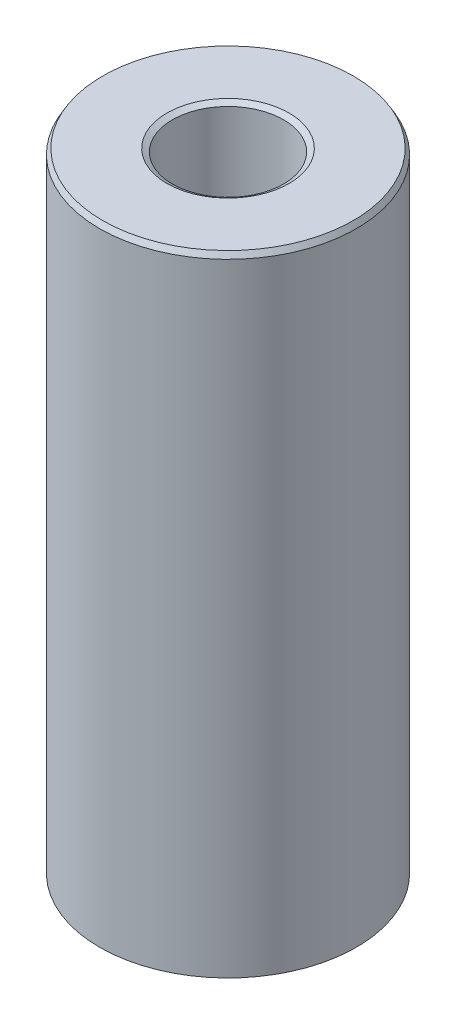
ISO-10303-21;
HEADER;
FILE_DESCRIPTION(('STEP AP214'),'2;1');
FILE_NAME('part.step','',(''),(''),'','','');
FILE_SCHEMA(('AUTOMOTIVE_DESIGN { 1 0 10303 214 1 1 1 1 }'));
ENDSEC;
DATA;
#1=APPLICATION_CONTEXT('core data for automotive mechanical design processes');
#2=APPLICATION_PROTOCOL_DEFINITION('international standard','automotive_design',2000,#1);
#3=PRODUCT_CONTEXT('',#1,'mechanical');
#4=PRODUCT('Part','Part','',(#3));
#5=PRODUCT_RELATED_PRODUCT_CATEGORY('part','',(#4));
#6=PRODUCT_DEFINITION_FORMATION('','',#4);
#7=PRODUCT_DEFINITION_CONTEXT('part definition',#1,'design');
#8=PRODUCT_DEFINITION('design','',#6,#7);
#9=PRODUCT_DEFINITION_SHAPE('','',#8);
#10=(LENGTH_UNIT() NAMED_UNIT(*) SI_UNIT(.MILLI.,.METRE.));
#11=(NAMED_UNIT(*) PLANE_ANGLE_UNIT() SI_UNIT($,.RADIAN.));
#12=(NAMED_UNIT(*) SI_UNIT($,.STERADIAN.) SOLID_ANGLE_UNIT());
#13=UNCERTAINTY_MEASURE_WITH_UNIT(LENGTH_MEASURE(1.E-05),#10,'distance_accuracy_value','');
#14=(GEOMETRIC_REPRESENTATION_CONTEXT(3) GLOBAL_UNCERTAINTY_ASSIGNED_CONTEXT((#13)) GLOBAL_UNIT_ASSIGNED_CONTEXT((#10,
#11,#12)) REPRESENTATION_CONTEXT('',''));
#15=CARTESIAN_POINT('',(0.,0.,0.));
#16=DIRECTION('',(0.,0.,1.));
#17=DIRECTION('',(1.,0.,0.));
#18=AXIS2_PLACEMENT_3D('',#15,#16,#17);
#19=CARTESIAN_POINT('',(0.,221.109307598909,0.));
#20=DIRECTION('',(0.,-1.,0.));
#21=DIRECTION('',(0.,0.,-1.));
#22=AXIS2_PLACEMENT_3D('',#19,#20,#21);
#23=CYLINDRICAL_SURFACE('',#22,45.);
#24=CARTESIAN_POINT('',(0.,1.09687432985134,0.));
#25=DIRECTION('',(0.,1.,0.));
#26=DIRECTION('',(0.,0.,1.));
#27=AXIS2_PLACEMENT_3D('',#24,#25,#26);
#28=CIRCLE('',#27,45.);
#29=CARTESIAN_POINT('',(0.,1.09687432985134,45.));
#30=VERTEX_POINT('',#29);
#31=EDGE_CURVE('E10',#30,#30,#28,.T.);
#32=ORIENTED_EDGE('',*,*,#31,.T.);
#33=EDGE_LOOP('',(#32));
#34=FACE_BOUND('',#33,.T.);
#35=CARTESIAN_POINT('',(0.,219.209465530089,0.));
#36=DIRECTION('',(0.,1.,0.));
#37=DIRECTION('',(0.,0.,1.));
#38=AXIS2_PLACEMENT_3D('',#35,#36,#37);
#39=CIRCLE('',#38,45.);
#40=CARTESIAN_POINT('',(0.,219.209465530089,-45.));
#41=VERTEX_POINT('',#40);
#42=EDGE_CURVE('E50',#41,#41,#39,.F.);
#43=ORIENTED_EDGE('',*,*,#42,.T.);
#44=EDGE_LOOP('',(#43));
#45=FACE_BOUND('',#44,.T.);
#46=ADVANCED_FACE('F39',(#34,#45),#23,.T.);
#47=CARTESIAN_POINT('',(0.,221.109307598909,0.));
#48=DIRECTION('',(0.,1.,0.));
#49=DIRECTION('',(0.,0.,1.));
#50=AXIS2_PLACEMENT_3D('',#47,#48,#49);
#51=PLANE('',#50);
#52=CARTESIAN_POINT('',(0.,221.109307598909,0.));
#53=DIRECTION('',(0.,1.,0.));
#54=DIRECTION('',(0.,0.,1.));
#55=AXIS2_PLACEMENT_3D('',#52,#53,#54);
#56=CIRCLE('',#55,21.4028291822832);
#57=CARTESIAN_POINT('',(0.,221.109307598909,21.4028291822832));
#58=VERTEX_POINT('',#57);
#59=EDGE_CURVE('E58',#58,#58,#56,.F.);
#60=ORIENTED_EDGE('',*,*,#59,.T.);
#61=EDGE_LOOP('',(#60));
#62=FACE_BOUND('',#61,.T.);
#63=CARTESIAN_POINT('',(0.,221.109307598909,0.));
#64=DIRECTION('',(0.,1.,0.));
#65=DIRECTION('',(0.,0.,1.));
#66=AXIS2_PLACEMENT_3D('',#63,#64,#65);
#67=CIRCLE('',#66,43.9031256701487);
#68=CARTESIAN_POINT('',(0.,221.109307598909,-43.9031256701487));
#69=VERTEX_POINT('',#68);
#70=EDGE_CURVE('E61',#69,#69,#67,.T.);
#71=ORIENTED_EDGE('',*,*,#70,.T.);
#72=EDGE_LOOP('',(#71));
#73=FACE_BOUND('',#72,.T.);
#74=ADVANCED_FACE('F88',(#62,#73),#51,.T.);
#75=CARTESIAN_POINT('',(0.,0.,0.));
#76=DIRECTION('',(0.,1.,0.));
#77=DIRECTION('',(0.,0.,1.));
#78=AXIS2_PLACEMENT_3D('',#75,#76,#77);
#79=PLANE('',#78);
#80=CARTESIAN_POINT('',(0.,0.,0.));
#81=DIRECTION('',(0.,1.,0.));
#82=DIRECTION('',(0.,0.,1.));
#83=AXIS2_PLACEMENT_3D('',#80,#81,#82);
#84=CIRCLE('',#83,20.5998614433139);
#85=CARTESIAN_POINT('',(0.,0.,20.5998614433139));
#86=VERTEX_POINT('',#85);
#87=EDGE_CURVE('E51',#86,#86,#84,.T.);
#88=ORIENTED_EDGE('',*,*,#87,.T.);
#89=EDGE_LOOP('',(#88));
#90=FACE_BOUND('',#89,.T.);
#91=CARTESIAN_POINT('',(0.,0.,0.));
#92=DIRECTION('',(0.,1.,0.));
#93=DIRECTION('',(0.,0.,1.));
#94=AXIS2_PLACEMENT_3D('',#91,#92,#93);
#95=CIRCLE('',#94,43.1001579311794);
#96=CARTESIAN_POINT('',(0.,0.,43.1001579311794));
#97=VERTEX_POINT('',#96);
#98=EDGE_CURVE('E54',#97,#97,#95,.F.);
#99=ORIENTED_EDGE('',*,*,#98,.T.);
#100=EDGE_LOOP('',(#99));
#101=FACE_BOUND('',#100,.T.);
#102=ADVANCED_FACE('F83',(#90,#101),#79,.F.);
#103=CARTESIAN_POINT('',(0.,221.109307598909,0.));
#104=DIRECTION('',(0.,-1.,0.));
#105=DIRECTION('',(0.,0.,-1.));
#106=AXIS2_PLACEMENT_3D('',#103,#104,#105);
#107=CYLINDRICAL_SURFACE('',#106,19.5029871134625);
#108=CARTESIAN_POINT('',(0.,220.012433269058,0.));
#109=DIRECTION('',(0.,1.,0.));
#110=DIRECTION('',(0.,0.,1.));
#111=AXIS2_PLACEMENT_3D('',#108,#109,#110);
#112=CIRCLE('',#111,19.5029871134625);
#113=CARTESIAN_POINT('',(0.,220.012433269058,19.5029871134625));
#114=VERTEX_POINT('',#113);
#115=EDGE_CURVE('E67',#114,#114,#112,.T.);
#116=ORIENTED_EDGE('',*,*,#115,.T.);
#117=EDGE_LOOP('',(#116));
#118=FACE_BOUND('',#117,.T.);
#119=CARTESIAN_POINT('',(0.,1.89984206882066,0.));
#120=DIRECTION('',(0.,1.,0.));
#121=DIRECTION('',(0.,0.,1.));
#122=AXIS2_PLACEMENT_3D('',#119,#120,#121);
#123=CIRCLE('',#122,19.5029871134625);
#124=CARTESIAN_POINT('',(0.,1.89984206882066,19.5029871134625));
#125=VERTEX_POINT('',#124);
#126=EDGE_CURVE('E69',#125,#125,#123,.F.);
#127=ORIENTED_EDGE('',*,*,#126,.T.);
#128=EDGE_LOOP('',(#127));
#129=FACE_BOUND('',#128,.T.);
#130=ADVANCED_FACE('F71',(#118,#129),#107,.F.);
#131=CARTESIAN_POINT('',(0.,220.012433269058,0.));
#132=DIRECTION('',(0.,1.,0.));
#133=DIRECTION('',(0.,0.,1.));
#134=AXIS2_PLACEMENT_3D('',#131,#132,#133);
#135=CONICAL_SURFACE('',#134,19.5029871134625,1.0471975511966);
#136=ORIENTED_EDGE('',*,*,#59,.F.);
#137=EDGE_LOOP('',(#136));
#138=FACE_BOUND('',#137,.T.);
#139=ORIENTED_EDGE('',*,*,#115,.F.);
#140=EDGE_LOOP('',(#139));
#141=FACE_BOUND('',#140,.T.);
#142=ADVANCED_FACE('F77',(#138,#141),#135,.F.);
#143=CARTESIAN_POINT('',(0.,0.,0.));
#144=DIRECTION('',(0.,-1.,0.));
#145=DIRECTION('',(0.,0.,-1.));
#146=AXIS2_PLACEMENT_3D('',#143,#144,#145);
#147=CONICAL_SURFACE('',#146,20.5998614433139,0.523598775598297);
#148=ORIENTED_EDGE('',*,*,#126,.F.);
#149=EDGE_LOOP('',(#148));
#150=FACE_BOUND('',#149,.T.);
#151=ORIENTED_EDGE('',*,*,#87,.F.);
#152=EDGE_LOOP('',(#151));
#153=FACE_BOUND('',#152,.T.);
#154=ADVANCED_FACE('F73',(#150,#153),#147,.F.);
#155=CARTESIAN_POINT('',(0.,1.09687432985134,0.));
#156=DIRECTION('',(0.,1.,0.));
#157=DIRECTION('',(0.,0.,1.));
#158=AXIS2_PLACEMENT_3D('',#155,#156,#157);
#159=CONICAL_SURFACE('',#158,45.,1.04719755119661);
#160=ORIENTED_EDGE('',*,*,#98,.F.);
#161=EDGE_LOOP('',(#160));
#162=FACE_BOUND('',#161,.T.);
#163=ORIENTED_EDGE('',*,*,#31,.F.);
#164=EDGE_LOOP('',(#163));
#165=FACE_BOUND('',#164,.T.);
#166=ADVANCED_FACE('F76',(#162,#165),#159,.T.);
#167=CARTESIAN_POINT('',(0.,221.109307598909,0.));
#168=DIRECTION('',(0.,-1.,0.));
#169=DIRECTION('',(0.,0.,-1.));
#170=AXIS2_PLACEMENT_3D('',#167,#168,#169);
#171=CONICAL_SURFACE('',#170,43.9031256701487,0.523598775598285);
#172=CARTESIAN_POINT('',(0.,219.209465530089,-45.));
#173=CARTESIAN_POINT('',(0.,219.229255551639,-44.9885742257307));
#174=CARTESIAN_POINT('',(0.,219.249045573189,-44.9771484514614));
#175=CARTESIAN_POINT('',(0.,219.28862561629,-44.9542969029229));
#176=CARTESIAN_POINT('',(0.,219.30841563784,-44.9428711286536));
#177=CARTESIAN_POINT('',(0.,219.34799568094,-44.920019580115));
#178=CARTESIAN_POINT('',(0.,219.367785702491,-44.9085938058457));
#179=CARTESIAN_POINT('',(0.,219.407365745591,-44.8857422573072));
#180=CARTESIAN_POINT('',(0.,219.427155767141,-44.8743164830379));
#181=CARTESIAN_POINT('',(0.,219.466735810242,-44.8514649344993));
#182=CARTESIAN_POINT('',(0.,219.486525831792,-44.84003916023));
#183=CARTESIAN_POINT('',(0.,219.526105874892,-44.8171876116915));
#184=CARTESIAN_POINT('',(0.,219.545895896442,-44.8057618374222));
#185=CARTESIAN_POINT('',(0.,219.585475939543,-44.7829102888836));
#186=CARTESIAN_POINT('',(0.,219.605265961093,-44.7714845146143));
#187=CARTESIAN_POINT('',(0.,219.644846004194,-44.7486329660757));
#188=CARTESIAN_POINT('',(0.,219.664636025744,-44.7372071918065));
#189=CARTESIAN_POINT('',(0.,219.704216068844,-44.7143556432679));
#190=CARTESIAN_POINT('',(0.,219.724006090394,-44.7029298689986));
#191=CARTESIAN_POINT('',(0.,219.763586133495,-44.68007832046));
#192=CARTESIAN_POINT('',(0.,219.783376155045,-44.6686525461908));
#193=CARTESIAN_POINT('',(0.,219.822956198146,-44.6458009976522));
#194=CARTESIAN_POINT('',(0.,219.842746219696,-44.6343752233829));
#195=CARTESIAN_POINT('',(0.,219.882326262796,-44.6115236748443));
#196=CARTESIAN_POINT('',(0.,219.902116284346,-44.6000979005751));
#197=CARTESIAN_POINT('',(0.,219.941696327447,-44.5772463520365));
#198=CARTESIAN_POINT('',(0.,219.961486348997,-44.5658205777672));
#199=CARTESIAN_POINT('',(0.,220.001066392097,-44.5429690292286));
#200=CARTESIAN_POINT('',(0.,220.020856413648,-44.5315432549593));
#201=CARTESIAN_POINT('',(0.,220.060436456748,-44.5086917064208));
#202=CARTESIAN_POINT('',(0.,220.080226478298,-44.4972659321515));
#203=CARTESIAN_POINT('',(0.,220.119806521399,-44.4744143836129));
#204=CARTESIAN_POINT('',(0.,220.139596542949,-44.4629886093436));
#205=CARTESIAN_POINT('',(0.,220.179176586049,-44.4401370608051));
#206=CARTESIAN_POINT('',(0.,220.1989666076,-44.4287112865358));
#207=CARTESIAN_POINT('',(0.,220.2385466507,-44.4058597379972));
#208=CARTESIAN_POINT('',(0.,220.25833667225,-44.3944339637279));
#209=CARTESIAN_POINT('',(0.,220.297916715351,-44.3715824151894));
#210=CARTESIAN_POINT('',(0.,220.317706736901,-44.3601566409201));
#211=CARTESIAN_POINT('',(0.,220.357286780001,-44.3373050923815));
#212=CARTESIAN_POINT('',(0.,220.377076801552,-44.3258793181122));
#213=CARTESIAN_POINT('',(0.,220.416656844652,-44.3030277695736));
#214=CARTESIAN_POINT('',(0.,220.436446866202,-44.2916019953044));
#215=CARTESIAN_POINT('',(0.,220.476026909303,-44.2687504467658));
#216=CARTESIAN_POINT('',(0.,220.495816930853,-44.2573246724965));
#217=CARTESIAN_POINT('',(0.,220.535396973953,-44.2344731239579));
#218=CARTESIAN_POINT('',(0.,220.555186995503,-44.2230473496887));
#219=CARTESIAN_POINT('',(0.,220.594767038604,-44.2001958011501));
#220=CARTESIAN_POINT('',(0.,220.614557060154,-44.1887700268808));
#221=CARTESIAN_POINT('',(0.,220.654137103255,-44.1659184783422));
#222=CARTESIAN_POINT('',(0.,220.673927124805,-44.154492704073));
#223=CARTESIAN_POINT('',(0.,220.713507167905,-44.1316411555344));
#224=CARTESIAN_POINT('',(0.,220.733297189455,-44.1202153812651));
#225=CARTESIAN_POINT('',(0.,220.772877232556,-44.0973638327265));
#226=CARTESIAN_POINT('',(0.,220.792667254106,-44.0859380584572));
#227=CARTESIAN_POINT('',(0.,220.832247297206,-44.0630865099187));
#228=CARTESIAN_POINT('',(0.,220.852037318757,-44.0516607356494));
#229=CARTESIAN_POINT('',(0.,220.891617361857,-44.0288091871108));
#230=CARTESIAN_POINT('',(0.,220.911407383407,-44.0173834128415));
#231=CARTESIAN_POINT('',(0.,220.950987426508,-43.994531864303));
#232=CARTESIAN_POINT('',(0.,220.970777448058,-43.9831060900337));
#233=CARTESIAN_POINT('',(0.,221.010357491158,-43.9602545414951));
#234=CARTESIAN_POINT('',(0.,221.030147512709,-43.9488287672258));
#235=CARTESIAN_POINT('',(0.,221.069727555809,-43.9259772186873));
#236=CARTESIAN_POINT('',(0.,221.089517577359,-43.914551444418));
#237=CARTESIAN_POINT('',(0.,221.109307598909,-43.9031256701487));
#238=B_SPLINE_CURVE_WITH_KNOTS('',3,(#172,#173,#174,#175,#176,#177,#178,#179,#180,#181,#182,
#183,#184,#185,#186,#187,#188,#189,#190,#191,#192,#193,#194,#195,#196,#197,#198,#199,#200,#201,
#202,#203,#204,#205,#206,#207,#208,#209,#210,#211,#212,#213,#214,#215,#216,#217,#218,#219,#220,
#221,#222,#223,#224,#225,#226,#227,#228,#229,#230,#231,#232,#233,#234,#235,#236,#237),
.UNSPECIFIED.,.F.,.F.,(4,2,2,2,2,2,2,2,2,2,2,2,2,2,2,2,2,2,2,2,2,2,2,2,2,2,2,2,2,2,2,2,4),(0.,
0.0685546456157145,0.137109291231426,0.20566393684714,0.274218582462855,0.342773228078566,
0.41132787369428,0.479882519309971,0.548437164925685,0.616991810541396,0.685546456157111,
0.754101101772825,0.822655747388536,0.891210393004227,0.959765038619941,1.02831968423566,
1.09687432985137,1.16542897546708,1.2339836210828,1.30253826669851,1.3710929123142,
1.43964755792991,1.50820220354563,1.57675684916134,1.64531149477705,1.71386614039277,
1.78242078600846,1.85097543162417,1.91953007723988,1.9880847228556,2.05663936847131,
2.12519401408702,2.19374865970274),.UNSPECIFIED.);
#239=EDGE_CURVE('BSEAM45',#41,#69,#238,.T.);
#240=ORIENTED_EDGE('',*,*,#42,.F.);
#241=ORIENTED_EDGE('',*,*,#70,.F.);
#242=ORIENTED_EDGE('',*,*,#239,.T.);
#243=ORIENTED_EDGE('',*,*,#239,.F.);
#244=EDGE_LOOP('',(#240,#242,#241,#243));
#245=FACE_BOUND('',#244,.T.);
#246=ADVANCED_FACE('F45',(#245),#171,.T.);
#247=CLOSED_SHELL('',(#46,#74,#102,#130,#142,#154,#166,#246));
#248=MANIFOLD_SOLID_BREP('B2',#247);
#249=ADVANCED_BREP_SHAPE_REPRESENTATION('',(#18,#248),#14);
#250=SHAPE_DEFINITION_REPRESENTATION(#9,#249);
ENDSEC;
END-ISO-10303-21;
